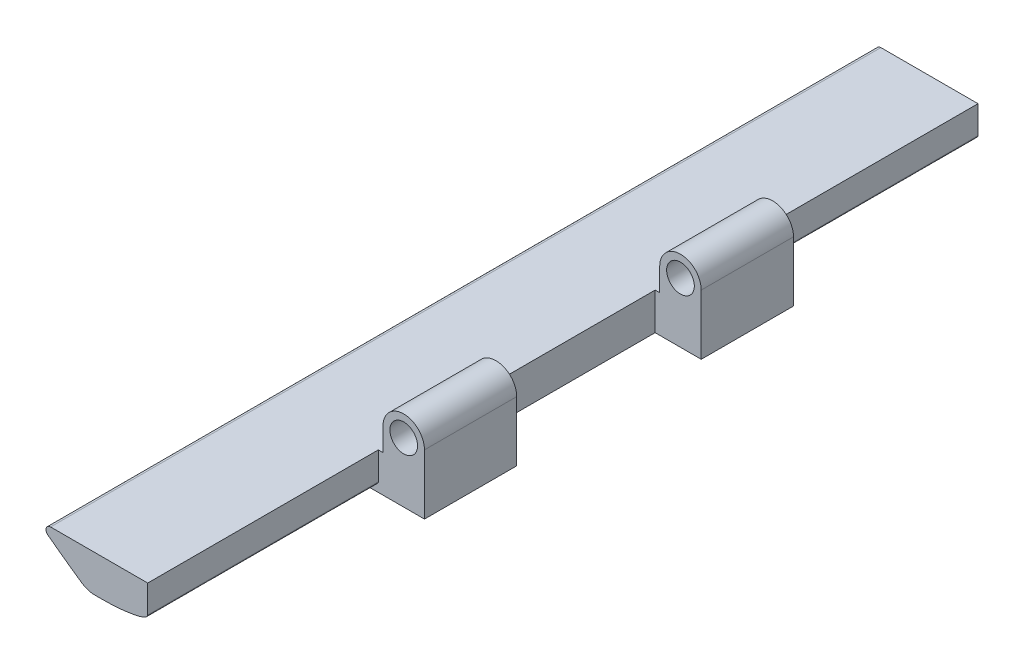
ISO-10303-21;
HEADER;
FILE_DESCRIPTION(('STEP AP214'),'2;1');
FILE_NAME('part.step','',(''),(''),'','','');
FILE_SCHEMA(('AUTOMOTIVE_DESIGN { 1 0 10303 214 1 1 1 1 }'));
ENDSEC;
DATA;
#1=APPLICATION_CONTEXT('core data for automotive mechanical design processes');
#2=APPLICATION_PROTOCOL_DEFINITION('international standard','automotive_design',2000,#1);
#3=PRODUCT_CONTEXT('',#1,'mechanical');
#4=PRODUCT('Part','Part','',(#3));
#5=PRODUCT_RELATED_PRODUCT_CATEGORY('part','',(#4));
#6=PRODUCT_DEFINITION_FORMATION('','',#4);
#7=PRODUCT_DEFINITION_CONTEXT('part definition',#1,'design');
#8=PRODUCT_DEFINITION('design','',#6,#7);
#9=PRODUCT_DEFINITION_SHAPE('','',#8);
#10=(LENGTH_UNIT() NAMED_UNIT(*) SI_UNIT(.MILLI.,.METRE.));
#11=(NAMED_UNIT(*) PLANE_ANGLE_UNIT() SI_UNIT($,.RADIAN.));
#12=(NAMED_UNIT(*) SI_UNIT($,.STERADIAN.) SOLID_ANGLE_UNIT());
#13=UNCERTAINTY_MEASURE_WITH_UNIT(LENGTH_MEASURE(1.E-05),#10,'distance_accuracy_value','');
#14=(GEOMETRIC_REPRESENTATION_CONTEXT(3) GLOBAL_UNCERTAINTY_ASSIGNED_CONTEXT((#13)) GLOBAL_UNIT_ASSIGNED_CONTEXT((#10,
#11,#12)) REPRESENTATION_CONTEXT('',''));
#15=CARTESIAN_POINT('',(0.,0.,0.));
#16=DIRECTION('',(0.,0.,1.));
#17=DIRECTION('',(1.,0.,0.));
#18=AXIS2_PLACEMENT_3D('',#15,#16,#17);
#19=CARTESIAN_POINT('',(75.1966347527541,0.,180.));
#20=DIRECTION('',(-1.,0.,0.));
#21=DIRECTION('',(0.,0.,1.));
#22=AXIS2_PLACEMENT_3D('',#19,#20,#21);
#23=PLANE('',#22);
#24=DIRECTION('',(0.,0.,-1.));
#25=VECTOR('',#24,1.);
#26=CARTESIAN_POINT('',(75.1966347527541,0.936560708709067,180.));
#27=LINE('',#26,#25);
#28=CARTESIAN_POINT('',(75.1966347527541,0.936560708709067,70.));
#29=VERTEX_POINT('',#28);
#30=CARTESIAN_POINT('',(75.1966347527541,0.936560708709067,50.));
#31=VERTEX_POINT('',#30);
#32=EDGE_CURVE('E345',#29,#31,#27,.T.);
#33=ORIENTED_EDGE('',*,*,#32,.F.);
#34=DIRECTION('',(0.,-1.,0.));
#35=VECTOR('',#34,1.);
#36=CARTESIAN_POINT('',(75.1966347527541,19.9365607087089,70.));
#37=LINE('',#36,#35);
#38=CARTESIAN_POINT('',(75.1966347527541,-12.0634392912909,70.));
#39=VERTEX_POINT('',#38);
#40=EDGE_CURVE('E226',#29,#39,#37,.T.);
#41=ORIENTED_EDGE('',*,*,#40,.T.);
#42=DIRECTION('',(0.,0.,-1.));
#43=VECTOR('',#42,1.);
#44=CARTESIAN_POINT('',(75.1966347527541,-12.0634392912909,180.));
#45=LINE('',#44,#43);
#46=CARTESIAN_POINT('',(75.1966347527541,-12.0634392912909,50.));
#47=VERTEX_POINT('',#46);
#48=EDGE_CURVE('E335',#39,#47,#45,.T.);
#49=ORIENTED_EDGE('',*,*,#48,.T.);
#50=DIRECTION('',(0.,-1.,0.));
#51=VECTOR('',#50,1.);
#52=CARTESIAN_POINT('',(75.1966347527541,19.9365607087089,50.));
#53=LINE('',#52,#51);
#54=EDGE_CURVE('E361',#31,#47,#53,.T.);
#55=ORIENTED_EDGE('',*,*,#54,.F.);
#56=EDGE_LOOP('',(#33,#41,#49,#55));
#57=FACE_BOUND('',#56,.T.);
#58=ADVANCED_FACE('F46',(#57),#23,.F.);
#59=CARTESIAN_POINT('',(70.6966347527542,0.936560708709067,180.));
#60=DIRECTION('',(0.,0.,-1.));
#61=DIRECTION('',(-1.,0.,0.));
#62=AXIS2_PLACEMENT_3D('',#59,#60,#61);
#63=CYLINDRICAL_SURFACE('',#62,4.5);
#64=DIRECTION('',(0.,0.,-1.));
#65=VECTOR('',#64,1.);
#66=CARTESIAN_POINT('',(66.1966347527541,0.936560708709067,180.));
#67=LINE('',#66,#65);
#68=CARTESIAN_POINT('',(66.1966347527541,0.936560708709067,70.));
#69=VERTEX_POINT('',#68);
#70=CARTESIAN_POINT('',(66.1966347527541,0.936560708709067,50.));
#71=VERTEX_POINT('',#70);
#72=EDGE_CURVE('E340',#69,#71,#67,.T.);
#73=ORIENTED_EDGE('',*,*,#72,.F.);
#74=CARTESIAN_POINT('',(70.6966347527542,0.936560708709067,70.));
#75=DIRECTION('',(0.,0.,-1.));
#76=DIRECTION('',(-1.,0.,0.));
#77=AXIS2_PLACEMENT_3D('',#74,#75,#76);
#78=CIRCLE('',#77,4.5);
#79=EDGE_CURVE('E252',#69,#29,#78,.T.);
#80=ORIENTED_EDGE('',*,*,#79,.T.);
#81=ORIENTED_EDGE('',*,*,#32,.T.);
#82=CARTESIAN_POINT('',(70.6966347527542,0.936560708709067,50.));
#83=DIRECTION('',(0.,0.,1.));
#84=DIRECTION('',(1.,0.,0.));
#85=AXIS2_PLACEMENT_3D('',#82,#83,#84);
#86=CIRCLE('',#85,4.5);
#87=EDGE_CURVE('E407',#31,#71,#86,.T.);
#88=ORIENTED_EDGE('',*,*,#87,.T.);
#89=EDGE_LOOP('',(#73,#80,#81,#88));
#90=FACE_BOUND('',#89,.T.);
#91=ADVANCED_FACE('F484',(#90),#63,.T.);
#92=CARTESIAN_POINT('',(66.1966347527541,0.,180.));
#93=DIRECTION('',(-1.,0.,0.));
#94=DIRECTION('',(0.,0.,1.));
#95=AXIS2_PLACEMENT_3D('',#92,#93,#94);
#96=PLANE('',#95);
#97=DIRECTION('',(0.,-1.,0.));
#98=VECTOR('',#97,1.);
#99=CARTESIAN_POINT('',(66.1966347527541,0.,70.));
#100=LINE('',#99,#98);
#101=CARTESIAN_POINT('',(66.1966347527541,-4.06343929129093,70.));
#102=VERTEX_POINT('',#101);
#103=EDGE_CURVE('E249',#69,#102,#100,.T.);
#104=ORIENTED_EDGE('',*,*,#103,.F.);
#105=ORIENTED_EDGE('',*,*,#72,.T.);
#106=DIRECTION('',(0.,1.,0.));
#107=VECTOR('',#106,1.);
#108=CARTESIAN_POINT('',(66.1966347527541,0.,50.));
#109=LINE('',#108,#107);
#110=CARTESIAN_POINT('',(66.1966347527541,-4.06343929129093,50.));
#111=VERTEX_POINT('',#110);
#112=EDGE_CURVE('E414',#111,#71,#109,.T.);
#113=ORIENTED_EDGE('',*,*,#112,.F.);
#114=DIRECTION('',(0.,0.,-1.));
#115=VECTOR('',#114,1.);
#116=CARTESIAN_POINT('',(66.1966347527541,-4.06343929129093,180.));
#117=LINE('',#116,#115);
#118=EDGE_CURVE('E334',#102,#111,#117,.T.);
#119=ORIENTED_EDGE('',*,*,#118,.F.);
#120=EDGE_LOOP('',(#104,#105,#113,#119));
#121=FACE_BOUND('',#120,.T.);
#122=ADVANCED_FACE('F479',(#121),#96,.T.);
#123=CARTESIAN_POINT('',(70.6966347527542,0.936560708709067,180.));
#124=DIRECTION('',(0.,0.,-1.));
#125=DIRECTION('',(-1.,0.,0.));
#126=AXIS2_PLACEMENT_3D('',#123,#124,#125);
#127=CYLINDRICAL_SURFACE('',#126,3.00000000000001);
#128=CARTESIAN_POINT('',(70.6966347527542,0.936560708709067,70.));
#129=DIRECTION('',(0.,0.,-1.));
#130=DIRECTION('',(-1.,0.,0.));
#131=AXIS2_PLACEMENT_3D('',#128,#129,#130);
#132=CIRCLE('',#131,3.00000000000001);
#133=CARTESIAN_POINT('',(67.6966347527541,0.936560708709067,70.));
#134=VERTEX_POINT('',#133);
#135=EDGE_CURVE('E245',#134,#134,#132,.T.);
#136=CARTESIAN_POINT('',(70.6966347527542,0.936560708709067,50.));
#137=DIRECTION('',(0.,0.,1.));
#138=DIRECTION('',(1.,0.,0.));
#139=AXIS2_PLACEMENT_3D('',#136,#137,#138);
#140=CIRCLE('',#139,3.00000000000001);
#141=CARTESIAN_POINT('',(67.6966347527541,0.936560708709067,50.));
#142=VERTEX_POINT('',#141);
#143=EDGE_CURVE('E594',#142,#142,#140,.T.);
#144=CARTESIAN_POINT('',(67.6966347527541,0.936560708709067,70.));
#145=CARTESIAN_POINT('',(67.6966347527541,0.936560708709067,69.7916666666667));
#146=CARTESIAN_POINT('',(67.6966347527541,0.936560708709067,69.5833333333334));
#147=CARTESIAN_POINT('',(67.6966347527541,0.936560708709067,69.1666666666667));
#148=CARTESIAN_POINT('',(67.6966347527541,0.936560708709067,68.9583333333334));
#149=CARTESIAN_POINT('',(67.6966347527541,0.936560708709067,68.5416666666667));
#150=CARTESIAN_POINT('',(67.6966347527541,0.936560708709067,68.3333333333334));
#151=CARTESIAN_POINT('',(67.6966347527541,0.936560708709067,67.9166666666667));
#152=CARTESIAN_POINT('',(67.6966347527541,0.936560708709067,67.7083333333334));
#153=CARTESIAN_POINT('',(67.6966347527541,0.936560708709067,67.2916666666667));
#154=CARTESIAN_POINT('',(67.6966347527541,0.936560708709067,67.0833333333333));
#155=CARTESIAN_POINT('',(67.6966347527541,0.936560708709067,66.6666666666667));
#156=CARTESIAN_POINT('',(67.6966347527541,0.936560708709067,66.4583333333333));
#157=CARTESIAN_POINT('',(67.6966347527541,0.936560708709067,66.0416666666667));
#158=CARTESIAN_POINT('',(67.6966347527541,0.936560708709067,65.8333333333333));
#159=CARTESIAN_POINT('',(67.6966347527541,0.936560708709067,65.4166666666667));
#160=CARTESIAN_POINT('',(67.6966347527541,0.936560708709067,65.2083333333333));
#161=CARTESIAN_POINT('',(67.6966347527541,0.936560708709067,64.7916666666667));
#162=CARTESIAN_POINT('',(67.6966347527541,0.936560708709067,64.5833333333333));
#163=CARTESIAN_POINT('',(67.6966347527541,0.936560708709067,64.1666666666667));
#164=CARTESIAN_POINT('',(67.6966347527541,0.936560708709067,63.9583333333333));
#165=CARTESIAN_POINT('',(67.6966347527541,0.936560708709067,63.5416666666667));
#166=CARTESIAN_POINT('',(67.6966347527541,0.936560708709067,63.3333333333333));
#167=CARTESIAN_POINT('',(67.6966347527541,0.936560708709067,62.9166666666667));
#168=CARTESIAN_POINT('',(67.6966347527541,0.936560708709067,62.7083333333333));
#169=CARTESIAN_POINT('',(67.6966347527541,0.936560708709067,62.2916666666667));
#170=CARTESIAN_POINT('',(67.6966347527541,0.936560708709067,62.0833333333333));
#171=CARTESIAN_POINT('',(67.6966347527541,0.936560708709067,61.6666666666667));
#172=CARTESIAN_POINT('',(67.6966347527541,0.936560708709067,61.4583333333333));
#173=CARTESIAN_POINT('',(67.6966347527541,0.936560708709067,61.0416666666667));
#174=CARTESIAN_POINT('',(67.6966347527541,0.936560708709067,60.8333333333333));
#175=CARTESIAN_POINT('',(67.6966347527541,0.936560708709067,60.4166666666667));
#176=CARTESIAN_POINT('',(67.6966347527541,0.936560708709067,60.2083333333333));
#177=CARTESIAN_POINT('',(67.6966347527541,0.936560708709067,59.7916666666667));
#178=CARTESIAN_POINT('',(67.6966347527541,0.936560708709067,59.5833333333333));
#179=CARTESIAN_POINT('',(67.6966347527541,0.936560708709067,59.1666666666667));
#180=CARTESIAN_POINT('',(67.6966347527541,0.936560708709067,58.9583333333333));
#181=CARTESIAN_POINT('',(67.6966347527541,0.936560708709067,58.5416666666667));
#182=CARTESIAN_POINT('',(67.6966347527541,0.936560708709067,58.3333333333333));
#183=CARTESIAN_POINT('',(67.6966347527541,0.936560708709067,57.9166666666667));
#184=CARTESIAN_POINT('',(67.6966347527541,0.936560708709067,57.7083333333333));
#185=CARTESIAN_POINT('',(67.6966347527541,0.936560708709067,57.2916666666666));
#186=CARTESIAN_POINT('',(67.6966347527541,0.936560708709067,57.0833333333333));
#187=CARTESIAN_POINT('',(67.6966347527541,0.936560708709067,56.6666666666666));
#188=CARTESIAN_POINT('',(67.6966347527541,0.936560708709067,56.4583333333333));
#189=CARTESIAN_POINT('',(67.6966347527541,0.936560708709067,56.0416666666666));
#190=CARTESIAN_POINT('',(67.6966347527541,0.936560708709067,55.8333333333333));
#191=CARTESIAN_POINT('',(67.6966347527541,0.936560708709067,55.4166666666666));
#192=CARTESIAN_POINT('',(67.6966347527541,0.936560708709067,55.2083333333333));
#193=CARTESIAN_POINT('',(67.6966347527541,0.936560708709067,54.7916666666666));
#194=CARTESIAN_POINT('',(67.6966347527541,0.936560708709067,54.5833333333333));
#195=CARTESIAN_POINT('',(67.6966347527541,0.936560708709067,54.1666666666666));
#196=CARTESIAN_POINT('',(67.6966347527541,0.936560708709067,53.9583333333333));
#197=CARTESIAN_POINT('',(67.6966347527541,0.936560708709067,53.5416666666666));
#198=CARTESIAN_POINT('',(67.6966347527541,0.936560708709067,53.3333333333333));
#199=CARTESIAN_POINT('',(67.6966347527541,0.936560708709067,52.9166666666666));
#200=CARTESIAN_POINT('',(67.6966347527541,0.936560708709067,52.7083333333333));
#201=CARTESIAN_POINT('',(67.6966347527541,0.936560708709067,52.2916666666666));
#202=CARTESIAN_POINT('',(67.6966347527541,0.936560708709067,52.0833333333333));
#203=CARTESIAN_POINT('',(67.6966347527541,0.936560708709067,51.6666666666666));
#204=CARTESIAN_POINT('',(67.6966347527541,0.936560708709067,51.4583333333333));
#205=CARTESIAN_POINT('',(67.6966347527541,0.936560708709067,51.0416666666666));
#206=CARTESIAN_POINT('',(67.6966347527541,0.936560708709067,50.8333333333333));
#207=CARTESIAN_POINT('',(67.6966347527541,0.936560708709067,50.4166666666666));
#208=CARTESIAN_POINT('',(67.6966347527541,0.936560708709067,50.2083333333333));
#209=CARTESIAN_POINT('',(67.6966347527541,0.936560708709067,50.));
#210=B_SPLINE_CURVE_WITH_KNOTS('',3,(#144,#145,#146,#147,#148,#149,#150,#151,#152,#153,#154,
#155,#156,#157,#158,#159,#160,#161,#162,#163,#164,#165,#166,#167,#168,#169,#170,#171,#172,#173,
#174,#175,#176,#177,#178,#179,#180,#181,#182,#183,#184,#185,#186,#187,#188,#189,#190,#191,#192,
#193,#194,#195,#196,#197,#198,#199,#200,#201,#202,#203,#204,#205,#206,#207,#208,#209),
.UNSPECIFIED.,.F.,.F.,(4,2,2,2,2,2,2,2,2,2,2,2,2,2,2,2,2,2,2,2,2,2,2,2,2,2,2,2,2,2,2,2,4),(0.,
0.625000000000001,1.25,1.875,2.5,3.12500000000002,3.75000000000002,4.37500000000002,
5.00000000000002,5.62500000000002,6.25000000000002,6.87500000000002,7.50000000000003,
8.12500000000004,8.75000000000004,9.37500000000004,10.,10.625,11.25,11.875,12.5,
13.1250000000001,13.7500000000001,14.3750000000001,15.0000000000001,15.625,16.2500000000001,
16.875,17.5000000000001,18.125,18.7500000000001,19.3750000000001,20.0000000000001),.UNSPECIFIED.);
#211=EDGE_CURVE('BSEAM400',#134,#142,#210,.T.);
#212=ORIENTED_EDGE('',*,*,#135,.F.);
#213=ORIENTED_EDGE('',*,*,#143,.F.);
#214=ORIENTED_EDGE('',*,*,#211,.T.);
#215=ORIENTED_EDGE('',*,*,#211,.F.);
#216=EDGE_LOOP('',(#212,#214,#213,#215));
#217=FACE_BOUND('',#216,.T.);
#218=ADVANCED_FACE('F400',(#217),#127,.F.);
#219=CARTESIAN_POINT('',(75.1966347527541,-12.0634392912909,130.));
#220=VERTEX_POINT('',#219);
#221=CARTESIAN_POINT('',(75.1966347527541,-12.0634392912909,110.));
#222=VERTEX_POINT('',#221);
#223=EDGE_CURVE('E331',#220,#222,#45,.T.);
#224=ORIENTED_EDGE('',*,*,#223,.T.);
#225=DIRECTION('',(0.,-1.,0.));
#226=VECTOR('',#225,1.);
#227=CARTESIAN_POINT('',(75.1966347527541,19.9365607087089,110.));
#228=LINE('',#227,#226);
#229=CARTESIAN_POINT('',(75.1966347527541,0.936560708709067,110.));
#230=VERTEX_POINT('',#229);
#231=EDGE_CURVE('E206',#230,#222,#228,.T.);
#232=ORIENTED_EDGE('',*,*,#231,.F.);
#233=CARTESIAN_POINT('',(75.1966347527541,0.936560708709067,130.));
#234=VERTEX_POINT('',#233);
#235=EDGE_CURVE('E346',#234,#230,#27,.T.);
#236=ORIENTED_EDGE('',*,*,#235,.F.);
#237=DIRECTION('',(0.,-1.,0.));
#238=VECTOR('',#237,1.);
#239=CARTESIAN_POINT('',(75.1966347527541,19.9365607087089,130.));
#240=LINE('',#239,#238);
#241=EDGE_CURVE('E259',#234,#220,#240,.T.);
#242=ORIENTED_EDGE('',*,*,#241,.T.);
#243=EDGE_LOOP('',(#224,#232,#236,#242));
#244=FACE_BOUND('',#243,.T.);
#245=ADVANCED_FACE('F482',(#244),#23,.F.);
#246=ORIENTED_EDGE('',*,*,#235,.T.);
#247=CARTESIAN_POINT('',(70.6966347527542,0.936560708709067,110.));
#248=DIRECTION('',(0.,0.,1.));
#249=DIRECTION('',(1.,0.,0.));
#250=AXIS2_PLACEMENT_3D('',#247,#248,#249);
#251=CIRCLE('',#250,4.5);
#252=CARTESIAN_POINT('',(66.1966347527541,0.936560708709067,110.));
#253=VERTEX_POINT('',#252);
#254=EDGE_CURVE('E241',#230,#253,#251,.T.);
#255=ORIENTED_EDGE('',*,*,#254,.T.);
#256=CARTESIAN_POINT('',(66.1966347527541,0.936560708709067,130.));
#257=VERTEX_POINT('',#256);
#258=EDGE_CURVE('E341',#257,#253,#67,.T.);
#259=ORIENTED_EDGE('',*,*,#258,.F.);
#260=CARTESIAN_POINT('',(70.6966347527542,0.936560708709067,130.));
#261=DIRECTION('',(0.,0.,-1.));
#262=DIRECTION('',(-1.,0.,0.));
#263=AXIS2_PLACEMENT_3D('',#260,#261,#262);
#264=CIRCLE('',#263,4.5);
#265=EDGE_CURVE('E420',#257,#234,#264,.T.);
#266=ORIENTED_EDGE('',*,*,#265,.T.);
#267=EDGE_LOOP('',(#246,#255,#259,#266));
#268=FACE_BOUND('',#267,.T.);
#269=ADVANCED_FACE('F477',(#268),#63,.T.);
#270=DIRECTION('',(0.,1.,0.));
#271=VECTOR('',#270,1.);
#272=CARTESIAN_POINT('',(66.1966347527541,0.,110.));
#273=LINE('',#272,#271);
#274=CARTESIAN_POINT('',(66.1966347527541,-4.06343929129093,110.));
#275=VERTEX_POINT('',#274);
#276=EDGE_CURVE('E238',#275,#253,#273,.T.);
#277=ORIENTED_EDGE('',*,*,#276,.F.);
#278=CARTESIAN_POINT('',(66.1966347527541,-4.06343929129093,130.));
#279=VERTEX_POINT('',#278);
#280=EDGE_CURVE('E336',#279,#275,#117,.T.);
#281=ORIENTED_EDGE('',*,*,#280,.F.);
#282=DIRECTION('',(0.,-1.,0.));
#283=VECTOR('',#282,1.);
#284=CARTESIAN_POINT('',(66.1966347527541,0.,130.));
#285=LINE('',#284,#283);
#286=EDGE_CURVE('E411',#257,#279,#285,.T.);
#287=ORIENTED_EDGE('',*,*,#286,.F.);
#288=ORIENTED_EDGE('',*,*,#258,.T.);
#289=EDGE_LOOP('',(#277,#281,#287,#288));
#290=FACE_BOUND('',#289,.T.);
#291=ADVANCED_FACE('F473',(#290),#96,.T.);
#292=CARTESIAN_POINT('',(0.,-4.06343929129093,180.));
#293=DIRECTION('',(0.,1.,0.));
#294=DIRECTION('',(0.,0.,1.));
#295=AXIS2_PLACEMENT_3D('',#292,#293,#294);
#296=PLANE('',#295);
#297=DIRECTION('',(1.,0.,0.));
#298=VECTOR('',#297,1.);
#299=CARTESIAN_POINT('',(0.,-4.06343929129093,0.));
#300=LINE('',#299,#298);
#301=CARTESIAN_POINT('',(44.1453638656436,-4.06343929129093,0.));
#302=VERTEX_POINT('',#301);
#303=CARTESIAN_POINT('',(65.1966347527541,-4.06343929129093,0.));
#304=VERTEX_POINT('',#303);
#305=EDGE_CURVE('E424',#302,#304,#300,.T.);
#306=ORIENTED_EDGE('',*,*,#305,.F.);
#307=DIRECTION('',(0.,0.,1.));
#308=VECTOR('',#307,1.);
#309=CARTESIAN_POINT('',(44.1453638656436,-4.06343929129093,180.));
#310=LINE('',#309,#308);
#311=CARTESIAN_POINT('',(44.1453638656436,-4.06343929129093,180.));
#312=VERTEX_POINT('',#311);
#313=EDGE_CURVE('E379',#302,#312,#310,.T.);
#314=ORIENTED_EDGE('',*,*,#313,.T.);
#315=DIRECTION('',(1.,0.,0.));
#316=VECTOR('',#315,1.);
#317=CARTESIAN_POINT('',(0.,-4.06343929129093,180.));
#318=LINE('',#317,#316);
#319=CARTESIAN_POINT('',(65.1966347527541,-4.06343929129093,180.));
#320=VERTEX_POINT('',#319);
#321=EDGE_CURVE('E324',#312,#320,#318,.T.);
#322=ORIENTED_EDGE('',*,*,#321,.T.);
#323=DIRECTION('',(0.,0.,1.));
#324=VECTOR('',#323,1.);
#325=CARTESIAN_POINT('',(65.1966347527541,-4.06343929129093,180.));
#326=LINE('',#325,#324);
#327=CARTESIAN_POINT('',(65.1966347527541,-4.06343929129093,130.));
#328=VERTEX_POINT('',#327);
#329=EDGE_CURVE('E592',#328,#320,#326,.T.);
#330=ORIENTED_EDGE('',*,*,#329,.F.);
#331=DIRECTION('',(-1.,0.,0.));
#332=VECTOR('',#331,1.);
#333=CARTESIAN_POINT('',(0.,-4.06343929129093,130.));
#334=LINE('',#333,#332);
#335=EDGE_CURVE('E406',#279,#328,#334,.T.);
#336=ORIENTED_EDGE('',*,*,#335,.F.);
#337=ORIENTED_EDGE('',*,*,#280,.T.);
#338=DIRECTION('',(1.,0.,0.));
#339=VECTOR('',#338,1.);
#340=CARTESIAN_POINT('',(0.,-4.06343929129093,110.));
#341=LINE('',#340,#339);
#342=CARTESIAN_POINT('',(65.1966347527541,-4.06343929129093,110.));
#343=VERTEX_POINT('',#342);
#344=EDGE_CURVE('E235',#343,#275,#341,.T.);
#345=ORIENTED_EDGE('',*,*,#344,.F.);
#346=DIRECTION('',(0.,0.,1.));
#347=VECTOR('',#346,1.);
#348=CARTESIAN_POINT('',(65.1966347527541,-4.06343929129093,180.));
#349=LINE('',#348,#347);
#350=CARTESIAN_POINT('',(65.1966347527541,-4.06343929129093,70.));
#351=VERTEX_POINT('',#350);
#352=EDGE_CURVE('E201',#351,#343,#349,.T.);
#353=ORIENTED_EDGE('',*,*,#352,.F.);
#354=DIRECTION('',(-1.,0.,0.));
#355=VECTOR('',#354,1.);
#356=CARTESIAN_POINT('',(0.,-4.06343929129093,70.));
#357=LINE('',#356,#355);
#358=EDGE_CURVE('E246',#102,#351,#357,.T.);
#359=ORIENTED_EDGE('',*,*,#358,.F.);
#360=ORIENTED_EDGE('',*,*,#118,.T.);
#361=DIRECTION('',(1.,0.,0.));
#362=VECTOR('',#361,1.);
#363=CARTESIAN_POINT('',(0.,-4.06343929129093,50.));
#364=LINE('',#363,#362);
#365=CARTESIAN_POINT('',(65.1966347527541,-4.06343929129093,50.));
#366=VERTEX_POINT('',#365);
#367=EDGE_CURVE('E615',#366,#111,#364,.T.);
#368=ORIENTED_EDGE('',*,*,#367,.F.);
#369=DIRECTION('',(0.,0.,1.));
#370=VECTOR('',#369,1.);
#371=CARTESIAN_POINT('',(65.1966347527541,-4.06343929129093,180.));
#372=LINE('',#371,#370);
#373=EDGE_CURVE('E263',#304,#366,#372,.T.);
#374=ORIENTED_EDGE('',*,*,#373,.F.);
#375=EDGE_LOOP('',(#306,#314,#322,#330,#336,#337,#345,#353,#359,#360,#368,#374));
#376=FACE_BOUND('',#375,.T.);
#377=ADVANCED_FACE('F469',(#376),#296,.T.);
#378=CARTESIAN_POINT('',(171.337403754055,163.317618085498,180.));
#379=DIRECTION('',(0.,0.,-1.));
#380=DIRECTION('',(-1.,0.,0.));
#381=AXIS2_PLACEMENT_3D('',#378,#379,#380);
#382=CYLINDRICAL_SURFACE('',#381,212.02131526057);
#383=CARTESIAN_POINT('',(171.337403754055,163.317618085498,0.));
#384=DIRECTION('',(0.,0.,1.));
#385=DIRECTION('',(1.,0.,0.));
#386=AXIS2_PLACEMENT_3D('',#383,#384,#385);
#387=CIRCLE('',#386,212.02131526057);
#388=CARTESIAN_POINT('',(43.5426188788096,-5.86137317379407,0.));
#389=VERTEX_POINT('',#388);
#390=CARTESIAN_POINT('',(50.9042567935745,-11.178500031832,0.));
#391=VERTEX_POINT('',#390);
#392=EDGE_CURVE('E325',#389,#391,#387,.T.);
#393=ORIENTED_EDGE('',*,*,#392,.T.);
#394=DIRECTION('',(0.,0.,-1.));
#395=VECTOR('',#394,1.);
#396=CARTESIAN_POINT('',(50.9042567935745,-11.178500031832,180.));
#397=LINE('',#396,#395);
#398=CARTESIAN_POINT('',(50.9042567935745,-11.178500031832,180.));
#399=VERTEX_POINT('',#398);
#400=EDGE_CURVE('E366',#391,#399,#397,.F.);
#401=ORIENTED_EDGE('',*,*,#400,.T.);
#402=CARTESIAN_POINT('',(171.337403754055,163.317618085498,180.));
#403=DIRECTION('',(0.,0.,1.));
#404=DIRECTION('',(1.,0.,0.));
#405=AXIS2_PLACEMENT_3D('',#402,#403,#404);
#406=CIRCLE('',#405,212.02131526057);
#407=CARTESIAN_POINT('',(43.5426188788096,-5.86137317379407,180.));
#408=VERTEX_POINT('',#407);
#409=EDGE_CURVE('E427',#408,#399,#406,.T.);
#410=ORIENTED_EDGE('',*,*,#409,.F.);
#411=DIRECTION('',(0.,0.,-1.));
#412=VECTOR('',#411,1.);
#413=CARTESIAN_POINT('',(43.5426188788096,-5.86137317379407,180.));
#414=LINE('',#413,#412);
#415=EDGE_CURVE('E385',#408,#389,#414,.T.);
#416=ORIENTED_EDGE('',*,*,#415,.T.);
#417=EDGE_LOOP('',(#393,#401,#410,#416));
#418=FACE_BOUND('',#417,.T.);
#419=ADVANCED_FACE('F456',(#418),#382,.T.);
#420=CARTESIAN_POINT('',(0.,-12.0634392912909,180.));
#421=DIRECTION('',(0.,1.,0.));
#422=DIRECTION('',(0.,0.,1.));
#423=AXIS2_PLACEMENT_3D('',#420,#421,#422);
#424=PLANE('',#423);
#425=DIRECTION('',(1.,0.,0.));
#426=VECTOR('',#425,1.);
#427=CARTESIAN_POINT('',(0.,-12.0634392912909,0.));
#428=LINE('',#427,#426);
#429=CARTESIAN_POINT('',(53.7443756470132,-12.0634392912909,0.));
#430=VERTEX_POINT('',#429);
#431=CARTESIAN_POINT('',(55.1966347527541,-12.0634392912909,0.));
#432=VERTEX_POINT('',#431);
#433=EDGE_CURVE('E315',#430,#432,#428,.T.);
#434=ORIENTED_EDGE('',*,*,#433,.T.);
#435=CARTESIAN_POINT('',(55.1966347527541,-12.0634392912909,52.5));
#436=CARTESIAN_POINT('',(55.1966347527541,-12.0634392912909,34.1666666666667));
#437=CARTESIAN_POINT('',(55.1966347527541,-12.0634392912909,15.8333333333333));
#438=CARTESIAN_POINT('',(55.1966347527541,-12.0634392912909,-2.49999999999999));
#439=(BOUNDED_CURVE() B_SPLINE_CURVE(3,(#435,#436,#437,#438),.UNSPECIFIED.,.F.,
.F.) B_SPLINE_CURVE_WITH_KNOTS((4,4),(-0.0525,0.0025),
.UNSPECIFIED.) CURVE() GEOMETRIC_REPRESENTATION_ITEM() RATIONAL_B_SPLINE_CURVE((1.,1.,1.,1.)) REPRESENTATION_ITEM(''));
#440=CARTESIAN_POINT('',(55.1966347527541,-12.0634392912909,50.));
#441=VERTEX_POINT('',#440);
#442=EDGE_CURVE('E533',#432,#441,#439,.F.);
#443=ORIENTED_EDGE('',*,*,#442,.T.);
#444=DIRECTION('',(-1.,0.,0.));
#445=VECTOR('',#444,1.);
#446=CARTESIAN_POINT('',(75.1966347527541,-12.0634392912909,50.));
#447=LINE('',#446,#445);
#448=EDGE_CURVE('E258',#47,#441,#447,.T.);
#449=ORIENTED_EDGE('',*,*,#448,.F.);
#450=ORIENTED_EDGE('',*,*,#48,.F.);
#451=DIRECTION('',(1.,0.,0.));
#452=VECTOR('',#451,1.);
#453=CARTESIAN_POINT('',(75.1966347527541,-12.0634392912909,70.));
#454=LINE('',#453,#452);
#455=CARTESIAN_POINT('',(65.1966347527541,-12.0634392912909,70.));
#456=VERTEX_POINT('',#455);
#457=EDGE_CURVE('E220',#456,#39,#454,.T.);
#458=ORIENTED_EDGE('',*,*,#457,.F.);
#459=DIRECTION('',(0.,0.,-1.));
#460=VECTOR('',#459,1.);
#461=CARTESIAN_POINT('',(65.1966347527541,-12.0634392912909,110.));
#462=LINE('',#461,#460);
#463=CARTESIAN_POINT('',(65.1966347527541,-12.0634392912909,110.));
#464=VERTEX_POINT('',#463);
#465=EDGE_CURVE('E198',#464,#456,#462,.T.);
#466=ORIENTED_EDGE('',*,*,#465,.F.);
#467=DIRECTION('',(-1.,0.,0.));
#468=VECTOR('',#467,1.);
#469=CARTESIAN_POINT('',(75.1966347527541,-12.0634392912909,110.));
#470=LINE('',#469,#468);
#471=EDGE_CURVE('E209',#222,#464,#470,.T.);
#472=ORIENTED_EDGE('',*,*,#471,.F.);
#473=ORIENTED_EDGE('',*,*,#223,.F.);
#474=DIRECTION('',(1.,0.,0.));
#475=VECTOR('',#474,1.);
#476=CARTESIAN_POINT('',(75.1966347527541,-12.0634392912909,130.));
#477=LINE('',#476,#475);
#478=CARTESIAN_POINT('',(55.1966347527541,-12.0634392912909,130.));
#479=VERTEX_POINT('',#478);
#480=EDGE_CURVE('E274',#479,#220,#477,.T.);
#481=ORIENTED_EDGE('',*,*,#480,.F.);
#482=CARTESIAN_POINT('',(55.1966347527541,-12.0634392912909,182.5));
#483=CARTESIAN_POINT('',(55.1966347527541,-12.0634392912909,164.166666666667));
#484=CARTESIAN_POINT('',(55.1966347527541,-12.0634392912909,145.833333333333));
#485=CARTESIAN_POINT('',(55.1966347527541,-12.0634392912909,127.5));
#486=(BOUNDED_CURVE() B_SPLINE_CURVE(3,(#482,#483,#484,#485),.UNSPECIFIED.,.F.,
.F.) B_SPLINE_CURVE_WITH_KNOTS((4,4),(-0.0025,0.0525),
.UNSPECIFIED.) CURVE() GEOMETRIC_REPRESENTATION_ITEM() RATIONAL_B_SPLINE_CURVE((1.,1.,1.,1.)) REPRESENTATION_ITEM(''));
#487=CARTESIAN_POINT('',(55.1966347527541,-12.0634392912909,180.));
#488=VERTEX_POINT('',#487);
#489=EDGE_CURVE('E441',#479,#488,#486,.F.);
#490=ORIENTED_EDGE('',*,*,#489,.T.);
#491=DIRECTION('',(1.,0.,0.));
#492=VECTOR('',#491,1.);
#493=CARTESIAN_POINT('',(0.,-12.0634392912909,180.));
#494=LINE('',#493,#492);
#495=CARTESIAN_POINT('',(53.7443756470132,-12.0634392912909,180.));
#496=VERTEX_POINT('',#495);
#497=EDGE_CURVE('E431',#496,#488,#494,.T.);
#498=ORIENTED_EDGE('',*,*,#497,.F.);
#499=DIRECTION('',(0.,0.,-1.));
#500=VECTOR('',#499,1.);
#501=CARTESIAN_POINT('',(53.7443756470132,-12.0634392912909,180.));
#502=LINE('',#501,#500);
#503=EDGE_CURVE('E372',#496,#430,#502,.T.);
#504=ORIENTED_EDGE('',*,*,#503,.T.);
#505=EDGE_LOOP('',(#434,#443,#449,#450,#458,#466,#472,#473,#481,#490,#498,#504));
#506=FACE_BOUND('',#505,.T.);
#507=ADVANCED_FACE('F218',(#506),#424,.F.);
#508=CARTESIAN_POINT('',(0.,0.,180.));
#509=DIRECTION('',(0.,0.,1.));
#510=DIRECTION('',(1.,0.,0.));
#511=AXIS2_PLACEMENT_3D('',#508,#509,#510);
#512=PLANE('',#511);
#513=ORIENTED_EDGE('',*,*,#497,.T.);
#514=CARTESIAN_POINT('',(65.1966347527541,-10.0634392912909,180.));
#515=CARTESIAN_POINT('',(65.1966347527541,-12.0634392912909,180.));
#516=CARTESIAN_POINT('',(55.1966347527541,-12.0634392912909,180.));
#517=(BOUNDED_CURVE() B_SPLINE_CURVE(2,(#514,#515,#516),.UNSPECIFIED.,.F.,
.F.) B_SPLINE_CURVE_WITH_KNOTS((3,3),(0.,1.),
.UNSPECIFIED.) CURVE() GEOMETRIC_REPRESENTATION_ITEM() RATIONAL_B_SPLINE_CURVE((1.,
0.707106781186548,1.)) REPRESENTATION_ITEM(''));
#518=CARTESIAN_POINT('',(65.1966347527541,-10.0634392912909,180.));
#519=VERTEX_POINT('',#518);
#520=EDGE_CURVE('E74',#488,#519,#517,.F.);
#521=ORIENTED_EDGE('',*,*,#520,.T.);
#522=DIRECTION('',(0.,-1.,0.));
#523=VECTOR('',#522,1.);
#524=CARTESIAN_POINT('',(65.1966347527541,0.,180.));
#525=LINE('',#524,#523);
#526=EDGE_CURVE('E275',#320,#519,#525,.T.);
#527=ORIENTED_EDGE('',*,*,#526,.F.);
#528=ORIENTED_EDGE('',*,*,#321,.F.);
#529=CARTESIAN_POINT('',(44.1453638656436,-5.06343929129088,180.));
#530=DIRECTION('',(0.,0.,1.));
#531=DIRECTION('',(1.,0.,0.));
#532=AXIS2_PLACEMENT_3D('',#529,#530,#531);
#533=CIRCLE('',#532,1.);
#534=EDGE_CURVE('E376',#312,#408,#533,.T.);
#535=ORIENTED_EDGE('',*,*,#534,.T.);
#536=ORIENTED_EDGE('',*,*,#409,.T.);
#537=CARTESIAN_POINT('',(53.7443756470132,-7.06343929129089,180.));
#538=DIRECTION('',(0.,0.,1.));
#539=DIRECTION('',(1.,0.,0.));
#540=AXIS2_PLACEMENT_3D('',#537,#538,#539);
#541=CIRCLE('',#540,5.);
#542=EDGE_CURVE('E362',#399,#496,#541,.T.);
#543=ORIENTED_EDGE('',*,*,#542,.T.);
#544=EDGE_LOOP('',(#513,#521,#527,#528,#535,#536,#543));
#545=FACE_BOUND('',#544,.T.);
#546=ADVANCED_FACE('F455',(#545),#512,.T.);
#547=CARTESIAN_POINT('',(0.,0.,0.));
#548=DIRECTION('',(0.,0.,1.));
#549=DIRECTION('',(1.,0.,0.));
#550=AXIS2_PLACEMENT_3D('',#547,#548,#549);
#551=PLANE('',#550);
#552=DIRECTION('',(0.,-1.,0.));
#553=VECTOR('',#552,1.);
#554=CARTESIAN_POINT('',(65.1966347527541,0.,0.));
#555=LINE('',#554,#553);
#556=CARTESIAN_POINT('',(65.1966347527541,-10.0634392912909,0.));
#557=VERTEX_POINT('',#556);
#558=EDGE_CURVE('E350',#304,#557,#555,.T.);
#559=ORIENTED_EDGE('',*,*,#558,.T.);
#560=CARTESIAN_POINT('',(55.1966347527541,-12.0634392912909,0.));
#561=CARTESIAN_POINT('',(65.1966347527541,-12.0634392912909,0.));
#562=CARTESIAN_POINT('',(65.1966347527541,-10.0634392912909,0.));
#563=(BOUNDED_CURVE() B_SPLINE_CURVE(2,(#560,#561,#562),.UNSPECIFIED.,.F.,
.F.) B_SPLINE_CURVE_WITH_KNOTS((3,3),(0.,1.),
.UNSPECIFIED.) CURVE() GEOMETRIC_REPRESENTATION_ITEM() RATIONAL_B_SPLINE_CURVE((1.,
0.707106781186548,1.)) REPRESENTATION_ITEM(''));
#564=EDGE_CURVE('E646',#557,#432,#563,.F.);
#565=ORIENTED_EDGE('',*,*,#564,.T.);
#566=ORIENTED_EDGE('',*,*,#433,.F.);
#567=CARTESIAN_POINT('',(53.7443756470132,-7.06343929129089,0.));
#568=DIRECTION('',(0.,0.,1.));
#569=DIRECTION('',(1.,0.,0.));
#570=AXIS2_PLACEMENT_3D('',#567,#568,#569);
#571=CIRCLE('',#570,5.);
#572=EDGE_CURVE('E369',#430,#391,#571,.F.);
#573=ORIENTED_EDGE('',*,*,#572,.T.);
#574=ORIENTED_EDGE('',*,*,#392,.F.);
#575=CARTESIAN_POINT('',(44.1453638656436,-5.06343929129088,0.));
#576=DIRECTION('',(0.,0.,1.));
#577=DIRECTION('',(1.,0.,0.));
#578=AXIS2_PLACEMENT_3D('',#575,#576,#577);
#579=CIRCLE('',#578,1.);
#580=EDGE_CURVE('E382',#389,#302,#579,.F.);
#581=ORIENTED_EDGE('',*,*,#580,.T.);
#582=ORIENTED_EDGE('',*,*,#305,.T.);
#583=EDGE_LOOP('',(#559,#565,#566,#573,#574,#581,#582));
#584=FACE_BOUND('',#583,.T.);
#585=ADVANCED_FACE('F457',(#584),#551,.F.);
#586=CARTESIAN_POINT('',(75.1966347527541,19.9365607087089,50.));
#587=DIRECTION('',(0.,0.,1.));
#588=DIRECTION('',(1.,0.,0.));
#589=AXIS2_PLACEMENT_3D('',#586,#587,#588);
#590=PLANE('',#589);
#591=ORIENTED_EDGE('',*,*,#143,.T.);
#592=EDGE_LOOP('',(#591));
#593=FACE_BOUND('',#592,.T.);
#594=ORIENTED_EDGE('',*,*,#54,.T.);
#595=ORIENTED_EDGE('',*,*,#448,.T.);
#596=CARTESIAN_POINT('',(65.1966347527541,-10.0634392912909,50.));
#597=CARTESIAN_POINT('',(65.1966347527541,-12.0634392912909,50.));
#598=CARTESIAN_POINT('',(55.1966347527541,-12.0634392912909,50.));
#599=(BOUNDED_CURVE() B_SPLINE_CURVE(2,(#596,#597,#598),.UNSPECIFIED.,.F.,
.F.) B_SPLINE_CURVE_WITH_KNOTS((3,3),(0.,1.),
.UNSPECIFIED.) CURVE() GEOMETRIC_REPRESENTATION_ITEM() RATIONAL_B_SPLINE_CURVE((1.,
0.707106781186548,1.)) REPRESENTATION_ITEM(''));
#600=CARTESIAN_POINT('',(65.1966347527541,-10.0634392912909,50.));
#601=VERTEX_POINT('',#600);
#602=EDGE_CURVE('E60',#441,#601,#599,.F.);
#603=ORIENTED_EDGE('',*,*,#602,.T.);
#604=DIRECTION('',(0.,-1.,0.));
#605=VECTOR('',#604,1.);
#606=CARTESIAN_POINT('',(65.1966347527541,19.9365607087089,50.));
#607=LINE('',#606,#605);
#608=EDGE_CURVE('E357',#366,#601,#607,.T.);
#609=ORIENTED_EDGE('',*,*,#608,.F.);
#610=ORIENTED_EDGE('',*,*,#367,.T.);
#611=ORIENTED_EDGE('',*,*,#112,.T.);
#612=ORIENTED_EDGE('',*,*,#87,.F.);
#613=EDGE_LOOP('',(#594,#595,#603,#609,#610,#611,#612));
#614=FACE_BOUND('',#613,.T.);
#615=ADVANCED_FACE('F304',(#593,#614),#590,.F.);
#616=CARTESIAN_POINT('',(65.1966347527541,19.9365607087089,0.));
#617=DIRECTION('',(-1.,0.,0.));
#618=DIRECTION('',(0.,0.,1.));
#619=AXIS2_PLACEMENT_3D('',#616,#617,#618);
#620=PLANE('',#619);
#621=ORIENTED_EDGE('',*,*,#608,.T.);
#622=CARTESIAN_POINT('',(65.1966347527541,-10.0634392912909,-2.49999999999999));
#623=CARTESIAN_POINT('',(65.1966347527541,-10.0634392912909,15.8333333333333));
#624=CARTESIAN_POINT('',(65.1966347527541,-10.0634392912909,34.1666666666667));
#625=CARTESIAN_POINT('',(65.1966347527541,-10.0634392912909,52.5));
#626=(BOUNDED_CURVE() B_SPLINE_CURVE(3,(#622,#623,#624,#625),.UNSPECIFIED.,.F.,
.F.) B_SPLINE_CURVE_WITH_KNOTS((4,4),(-0.0525,0.0025),
.UNSPECIFIED.) CURVE() GEOMETRIC_REPRESENTATION_ITEM() RATIONAL_B_SPLINE_CURVE((1.,1.,1.,1.)) REPRESENTATION_ITEM(''));
#627=EDGE_CURVE('E365',#601,#557,#626,.F.);
#628=ORIENTED_EDGE('',*,*,#627,.T.);
#629=ORIENTED_EDGE('',*,*,#558,.F.);
#630=ORIENTED_EDGE('',*,*,#373,.T.);
#631=EDGE_LOOP('',(#621,#628,#629,#630));
#632=FACE_BOUND('',#631,.T.);
#633=ADVANCED_FACE('F300',(#632),#620,.F.);
#634=CARTESIAN_POINT('',(75.1966347527541,19.9365607087089,130.));
#635=DIRECTION('',(0.,0.,-1.));
#636=DIRECTION('',(-1.,0.,0.));
#637=AXIS2_PLACEMENT_3D('',#634,#635,#636);
#638=PLANE('',#637);
#639=CARTESIAN_POINT('',(70.6966347527542,0.936560708709067,130.));
#640=DIRECTION('',(0.,0.,-1.));
#641=DIRECTION('',(-1.,0.,0.));
#642=AXIS2_PLACEMENT_3D('',#639,#640,#641);
#643=CIRCLE('',#642,3.00000000000001);
#644=CARTESIAN_POINT('',(67.6966347527541,0.936560708709067,130.));
#645=VERTEX_POINT('',#644);
#646=EDGE_CURVE('E403',#645,#645,#643,.T.);
#647=ORIENTED_EDGE('',*,*,#646,.T.);
#648=EDGE_LOOP('',(#647));
#649=FACE_BOUND('',#648,.T.);
#650=ORIENTED_EDGE('',*,*,#286,.T.);
#651=ORIENTED_EDGE('',*,*,#335,.T.);
#652=DIRECTION('',(0.,-1.,0.));
#653=VECTOR('',#652,1.);
#654=CARTESIAN_POINT('',(65.1966347527541,19.9365607087089,130.));
#655=LINE('',#654,#653);
#656=CARTESIAN_POINT('',(65.1966347527541,-10.0634392912909,130.));
#657=VERTEX_POINT('',#656);
#658=EDGE_CURVE('E264',#328,#657,#655,.T.);
#659=ORIENTED_EDGE('',*,*,#658,.T.);
#660=CARTESIAN_POINT('',(55.1966347527541,-12.0634392912909,130.));
#661=CARTESIAN_POINT('',(65.1966347527541,-12.0634392912909,130.));
#662=CARTESIAN_POINT('',(65.1966347527541,-10.0634392912909,130.));
#663=(BOUNDED_CURVE() B_SPLINE_CURVE(2,(#660,#661,#662),.UNSPECIFIED.,.F.,
.F.) B_SPLINE_CURVE_WITH_KNOTS((3,3),(0.,1.),
.UNSPECIFIED.) CURVE() GEOMETRIC_REPRESENTATION_ITEM() RATIONAL_B_SPLINE_CURVE((1.,
0.707106781186548,1.)) REPRESENTATION_ITEM(''));
#664=EDGE_CURVE('E12',#657,#479,#663,.F.);
#665=ORIENTED_EDGE('',*,*,#664,.T.);
#666=ORIENTED_EDGE('',*,*,#480,.T.);
#667=ORIENTED_EDGE('',*,*,#241,.F.);
#668=ORIENTED_EDGE('',*,*,#265,.F.);
#669=EDGE_LOOP('',(#650,#651,#659,#665,#666,#667,#668));
#670=FACE_BOUND('',#669,.T.);
#671=ADVANCED_FACE('F297',(#649,#670),#638,.F.);
#672=CARTESIAN_POINT('',(65.1966347527541,19.9365607087089,180.));
#673=DIRECTION('',(-1.,0.,0.));
#674=DIRECTION('',(0.,0.,1.));
#675=AXIS2_PLACEMENT_3D('',#672,#673,#674);
#676=PLANE('',#675);
#677=ORIENTED_EDGE('',*,*,#526,.T.);
#678=CARTESIAN_POINT('',(65.1966347527541,-10.0634392912909,127.5));
#679=CARTESIAN_POINT('',(65.1966347527541,-10.0634392912909,145.833333333333));
#680=CARTESIAN_POINT('',(65.1966347527541,-10.0634392912909,164.166666666667));
#681=CARTESIAN_POINT('',(65.1966347527541,-10.0634392912909,182.5));
#682=(BOUNDED_CURVE() B_SPLINE_CURVE(3,(#678,#679,#680,#681),.UNSPECIFIED.,.F.,
.F.) B_SPLINE_CURVE_WITH_KNOTS((4,4),(-0.0025,0.0525),
.UNSPECIFIED.) CURVE() GEOMETRIC_REPRESENTATION_ITEM() RATIONAL_B_SPLINE_CURVE((1.,1.,1.,1.)) REPRESENTATION_ITEM(''));
#683=EDGE_CURVE('E281',#519,#657,#682,.F.);
#684=ORIENTED_EDGE('',*,*,#683,.T.);
#685=ORIENTED_EDGE('',*,*,#658,.F.);
#686=ORIENTED_EDGE('',*,*,#329,.T.);
#687=EDGE_LOOP('',(#677,#684,#685,#686));
#688=FACE_BOUND('',#687,.T.);
#689=ADVANCED_FACE('F286',(#688),#676,.F.);
#690=CARTESIAN_POINT('',(70.6966347527542,0.936560708709067,110.));
#691=DIRECTION('',(0.,0.,1.));
#692=DIRECTION('',(1.,0.,0.));
#693=AXIS2_PLACEMENT_3D('',#690,#691,#692);
#694=CIRCLE('',#693,3.00000000000001);
#695=CARTESIAN_POINT('',(67.6966347527541,0.936560708709067,110.));
#696=VERTEX_POINT('',#695);
#697=EDGE_CURVE('E230',#696,#696,#694,.T.);
#698=CARTESIAN_POINT('',(67.6966347527541,0.936560708709067,110.));
#699=CARTESIAN_POINT('',(67.6966347527541,0.936560708709067,110.208333333333));
#700=CARTESIAN_POINT('',(67.6966347527541,0.936560708709067,110.416666666667));
#701=CARTESIAN_POINT('',(67.6966347527541,0.936560708709067,110.833333333333));
#702=CARTESIAN_POINT('',(67.6966347527541,0.936560708709067,111.041666666667));
#703=CARTESIAN_POINT('',(67.6966347527541,0.936560708709067,111.458333333333));
#704=CARTESIAN_POINT('',(67.6966347527541,0.936560708709067,111.666666666667));
#705=CARTESIAN_POINT('',(67.6966347527541,0.936560708709067,112.083333333333));
#706=CARTESIAN_POINT('',(67.6966347527541,0.936560708709067,112.291666666667));
#707=CARTESIAN_POINT('',(67.6966347527541,0.936560708709067,112.708333333333));
#708=CARTESIAN_POINT('',(67.6966347527541,0.936560708709067,112.916666666667));
#709=CARTESIAN_POINT('',(67.6966347527541,0.936560708709067,113.333333333333));
#710=CARTESIAN_POINT('',(67.6966347527541,0.936560708709067,113.541666666667));
#711=CARTESIAN_POINT('',(67.6966347527541,0.936560708709067,113.958333333333));
#712=CARTESIAN_POINT('',(67.6966347527541,0.936560708709067,114.166666666667));
#713=CARTESIAN_POINT('',(67.6966347527541,0.936560708709067,114.583333333333));
#714=CARTESIAN_POINT('',(67.6966347527541,0.936560708709067,114.791666666667));
#715=CARTESIAN_POINT('',(67.6966347527541,0.936560708709067,115.208333333333));
#716=CARTESIAN_POINT('',(67.6966347527541,0.936560708709067,115.416666666667));
#717=CARTESIAN_POINT('',(67.6966347527541,0.936560708709067,115.833333333333));
#718=CARTESIAN_POINT('',(67.6966347527541,0.936560708709067,116.041666666667));
#719=CARTESIAN_POINT('',(67.6966347527541,0.936560708709067,116.458333333333));
#720=CARTESIAN_POINT('',(67.6966347527541,0.936560708709067,116.666666666667));
#721=CARTESIAN_POINT('',(67.6966347527541,0.936560708709067,117.083333333333));
#722=CARTESIAN_POINT('',(67.6966347527541,0.936560708709067,117.291666666667));
#723=CARTESIAN_POINT('',(67.6966347527541,0.936560708709067,117.708333333333));
#724=CARTESIAN_POINT('',(67.6966347527541,0.936560708709067,117.916666666667));
#725=CARTESIAN_POINT('',(67.6966347527541,0.936560708709067,118.333333333333));
#726=CARTESIAN_POINT('',(67.6966347527541,0.936560708709067,118.541666666667));
#727=CARTESIAN_POINT('',(67.6966347527541,0.936560708709067,118.958333333333));
#728=CARTESIAN_POINT('',(67.6966347527541,0.936560708709067,119.166666666667));
#729=CARTESIAN_POINT('',(67.6966347527541,0.936560708709067,119.583333333333));
#730=CARTESIAN_POINT('',(67.6966347527541,0.936560708709067,119.791666666667));
#731=CARTESIAN_POINT('',(67.6966347527541,0.936560708709067,120.208333333333));
#732=CARTESIAN_POINT('',(67.6966347527541,0.936560708709067,120.416666666667));
#733=CARTESIAN_POINT('',(67.6966347527541,0.936560708709067,120.833333333333));
#734=CARTESIAN_POINT('',(67.6966347527541,0.936560708709067,121.041666666667));
#735=CARTESIAN_POINT('',(67.6966347527541,0.936560708709067,121.458333333333));
#736=CARTESIAN_POINT('',(67.6966347527541,0.936560708709067,121.666666666667));
#737=CARTESIAN_POINT('',(67.6966347527541,0.936560708709067,122.083333333333));
#738=CARTESIAN_POINT('',(67.6966347527541,0.936560708709067,122.291666666667));
#739=CARTESIAN_POINT('',(67.6966347527541,0.936560708709067,122.708333333333));
#740=CARTESIAN_POINT('',(67.6966347527541,0.936560708709067,122.916666666667));
#741=CARTESIAN_POINT('',(67.6966347527541,0.936560708709067,123.333333333333));
#742=CARTESIAN_POINT('',(67.6966347527541,0.936560708709067,123.541666666667));
#743=CARTESIAN_POINT('',(67.6966347527541,0.936560708709067,123.958333333333));
#744=CARTESIAN_POINT('',(67.6966347527541,0.936560708709067,124.166666666667));
#745=CARTESIAN_POINT('',(67.6966347527541,0.936560708709067,124.583333333333));
#746=CARTESIAN_POINT('',(67.6966347527541,0.936560708709067,124.791666666667));
#747=CARTESIAN_POINT('',(67.6966347527541,0.936560708709067,125.208333333333));
#748=CARTESIAN_POINT('',(67.6966347527541,0.936560708709067,125.416666666667));
#749=CARTESIAN_POINT('',(67.6966347527541,0.936560708709067,125.833333333333));
#750=CARTESIAN_POINT('',(67.6966347527541,0.936560708709067,126.041666666667));
#751=CARTESIAN_POINT('',(67.6966347527541,0.936560708709067,126.458333333333));
#752=CARTESIAN_POINT('',(67.6966347527541,0.936560708709067,126.666666666667));
#753=CARTESIAN_POINT('',(67.6966347527541,0.936560708709067,127.083333333333));
#754=CARTESIAN_POINT('',(67.6966347527541,0.936560708709067,127.291666666667));
#755=CARTESIAN_POINT('',(67.6966347527541,0.936560708709067,127.708333333333));
#756=CARTESIAN_POINT('',(67.6966347527541,0.936560708709067,127.916666666667));
#757=CARTESIAN_POINT('',(67.6966347527541,0.936560708709067,128.333333333333));
#758=CARTESIAN_POINT('',(67.6966347527541,0.936560708709067,128.541666666667));
#759=CARTESIAN_POINT('',(67.6966347527541,0.936560708709067,128.958333333333));
#760=CARTESIAN_POINT('',(67.6966347527541,0.936560708709067,129.166666666667));
#761=CARTESIAN_POINT('',(67.6966347527541,0.936560708709067,129.583333333333));
#762=CARTESIAN_POINT('',(67.6966347527541,0.936560708709067,129.791666666667));
#763=CARTESIAN_POINT('',(67.6966347527541,0.936560708709067,130.));
#764=B_SPLINE_CURVE_WITH_KNOTS('',3,(#698,#699,#700,#701,#702,#703,#704,#705,#706,#707,#708,
#709,#710,#711,#712,#713,#714,#715,#716,#717,#718,#719,#720,#721,#722,#723,#724,#725,#726,#727,
#728,#729,#730,#731,#732,#733,#734,#735,#736,#737,#738,#739,#740,#741,#742,#743,#744,#745,#746,
#747,#748,#749,#750,#751,#752,#753,#754,#755,#756,#757,#758,#759,#760,#761,#762,#763),
.UNSPECIFIED.,.F.,.F.,(4,2,2,2,2,2,2,2,2,2,2,2,2,2,2,2,2,2,2,2,2,2,2,2,2,2,2,2,2,2,2,2,4),(0.,
0.625000000000001,1.25,1.875,2.5,3.125,3.75,4.375,5.,5.62500000000001,6.25000000000001,
6.87500000000001,7.50000000000001,8.12500000000001,8.75000000000001,9.37500000000001,10.,10.625,
11.25,11.875,12.5,13.125,13.75,14.375,15.,15.625,16.25,16.875,17.5,18.125,18.75,19.375,20.),.UNSPECIFIED.);
#765=EDGE_CURVE('BSEAM296',#696,#645,#764,.T.);
#766=ORIENTED_EDGE('',*,*,#697,.F.);
#767=ORIENTED_EDGE('',*,*,#646,.F.);
#768=ORIENTED_EDGE('',*,*,#765,.T.);
#769=ORIENTED_EDGE('',*,*,#765,.F.);
#770=EDGE_LOOP('',(#766,#768,#767,#769));
#771=FACE_BOUND('',#770,.T.);
#772=ADVANCED_FACE('F296',(#771),#127,.F.);
#773=CARTESIAN_POINT('',(75.1966347527541,19.9365607087089,70.));
#774=DIRECTION('',(0.,0.,-1.));
#775=DIRECTION('',(-1.,0.,0.));
#776=AXIS2_PLACEMENT_3D('',#773,#774,#775);
#777=PLANE('',#776);
#778=ORIENTED_EDGE('',*,*,#135,.T.);
#779=EDGE_LOOP('',(#778));
#780=FACE_BOUND('',#779,.T.);
#781=ORIENTED_EDGE('',*,*,#103,.T.);
#782=ORIENTED_EDGE('',*,*,#358,.T.);
#783=DIRECTION('',(0.,-1.,0.));
#784=VECTOR('',#783,1.);
#785=CARTESIAN_POINT('',(65.1966347527541,19.9365607087089,70.));
#786=LINE('',#785,#784);
#787=EDGE_CURVE('E205',#351,#456,#786,.T.);
#788=ORIENTED_EDGE('',*,*,#787,.T.);
#789=ORIENTED_EDGE('',*,*,#457,.T.);
#790=ORIENTED_EDGE('',*,*,#40,.F.);
#791=ORIENTED_EDGE('',*,*,#79,.F.);
#792=EDGE_LOOP('',(#781,#782,#788,#789,#790,#791));
#793=FACE_BOUND('',#792,.T.);
#794=ADVANCED_FACE('F398',(#780,#793),#777,.F.);
#795=CARTESIAN_POINT('',(75.1966347527541,19.9365607087089,110.));
#796=DIRECTION('',(0.,0.,1.));
#797=DIRECTION('',(1.,0.,0.));
#798=AXIS2_PLACEMENT_3D('',#795,#796,#797);
#799=PLANE('',#798);
#800=ORIENTED_EDGE('',*,*,#697,.T.);
#801=EDGE_LOOP('',(#800));
#802=FACE_BOUND('',#801,.T.);
#803=ORIENTED_EDGE('',*,*,#231,.T.);
#804=ORIENTED_EDGE('',*,*,#471,.T.);
#805=DIRECTION('',(0.,-1.,0.));
#806=VECTOR('',#805,1.);
#807=CARTESIAN_POINT('',(65.1966347527541,19.9365607087089,110.));
#808=LINE('',#807,#806);
#809=EDGE_CURVE('E193',#343,#464,#808,.T.);
#810=ORIENTED_EDGE('',*,*,#809,.F.);
#811=ORIENTED_EDGE('',*,*,#344,.T.);
#812=ORIENTED_EDGE('',*,*,#276,.T.);
#813=ORIENTED_EDGE('',*,*,#254,.F.);
#814=EDGE_LOOP('',(#803,#804,#810,#811,#812,#813));
#815=FACE_BOUND('',#814,.T.);
#816=ADVANCED_FACE('F210',(#802,#815),#799,.F.);
#817=CARTESIAN_POINT('',(65.1966347527541,19.9365607087089,110.));
#818=DIRECTION('',(-1.,0.,0.));
#819=DIRECTION('',(0.,0.,1.));
#820=AXIS2_PLACEMENT_3D('',#817,#818,#819);
#821=PLANE('',#820);
#822=ORIENTED_EDGE('',*,*,#352,.T.);
#823=ORIENTED_EDGE('',*,*,#809,.T.);
#824=ORIENTED_EDGE('',*,*,#465,.T.);
#825=ORIENTED_EDGE('',*,*,#787,.F.);
#826=EDGE_LOOP('',(#822,#823,#824,#825));
#827=FACE_BOUND('',#826,.T.);
#828=ADVANCED_FACE('F195',(#827),#821,.F.);
#829=CARTESIAN_POINT('',(44.1453638656436,-5.06343929129088,180.));
#830=DIRECTION('',(0.,0.,-1.));
#831=DIRECTION('',(-1.,0.,0.));
#832=AXIS2_PLACEMENT_3D('',#829,#830,#831);
#833=CYLINDRICAL_SURFACE('',#832,1.);
#834=ORIENTED_EDGE('',*,*,#534,.F.);
#835=ORIENTED_EDGE('',*,*,#313,.F.);
#836=ORIENTED_EDGE('',*,*,#580,.F.);
#837=ORIENTED_EDGE('',*,*,#415,.F.);
#838=EDGE_LOOP('',(#834,#835,#836,#837));
#839=FACE_BOUND('',#838,.T.);
#840=ADVANCED_FACE('F488',(#839),#833,.T.);
#841=CARTESIAN_POINT('',(53.7443756470132,-7.06343929129089,180.));
#842=DIRECTION('',(0.,0.,-1.));
#843=DIRECTION('',(-1.,0.,0.));
#844=AXIS2_PLACEMENT_3D('',#841,#842,#843);
#845=CYLINDRICAL_SURFACE('',#844,5.);
#846=ORIENTED_EDGE('',*,*,#542,.F.);
#847=ORIENTED_EDGE('',*,*,#400,.F.);
#848=ORIENTED_EDGE('',*,*,#572,.F.);
#849=ORIENTED_EDGE('',*,*,#503,.F.);
#850=EDGE_LOOP('',(#846,#847,#848,#849));
#851=FACE_BOUND('',#850,.T.);
#852=ADVANCED_FACE('F491',(#851),#845,.T.);
#853=CARTESIAN_POINT('',(65.1966347527541,-10.0634392912909,52.5));
#854=CARTESIAN_POINT('',(65.1966347527541,-10.0634392912909,34.1666666666667));
#855=CARTESIAN_POINT('',(65.1966347527541,-10.0634392912909,15.8333333333333));
#856=CARTESIAN_POINT('',(65.1966347527541,-10.0634392912909,-2.49999999999999));
#857=CARTESIAN_POINT('',(65.1966347527541,-12.0634392912909,52.5));
#858=CARTESIAN_POINT('',(65.1966347527541,-12.0634392912909,34.1666666666667));
#859=CARTESIAN_POINT('',(65.1966347527541,-12.0634392912909,15.8333333333333));
#860=CARTESIAN_POINT('',(65.1966347527541,-12.0634392912909,-2.49999999999999));
#861=CARTESIAN_POINT('',(55.1966347527541,-12.0634392912909,52.5));
#862=CARTESIAN_POINT('',(55.1966347527541,-12.0634392912909,34.1666666666667));
#863=CARTESIAN_POINT('',(55.1966347527541,-12.0634392912909,15.8333333333333));
#864=CARTESIAN_POINT('',(55.1966347527541,-12.0634392912909,-2.49999999999999));
#865=(BOUNDED_SURFACE() B_SPLINE_SURFACE(2,3,((#853,#854,#855,#856),(#857,#858,#859,#860),(#861,
#862,#863,#864)),.UNSPECIFIED.,.F.,.F.,.F.) B_SPLINE_SURFACE_WITH_KNOTS((3,3),(4,4),(0.,1.),
(-0.0525,0.0025),.UNSPECIFIED.) GEOMETRIC_REPRESENTATION_ITEM() RATIONAL_B_SPLINE_SURFACE(((1.,
1.,1.,1.),(0.707106781186548,0.707106781186548,0.707106781186548,0.707106781186548),(1.,1.,1.,1.))) REPRESENTATION_ITEM('') SURFACE());
#866=ORIENTED_EDGE('',*,*,#602,.F.);
#867=ORIENTED_EDGE('',*,*,#442,.F.);
#868=ORIENTED_EDGE('',*,*,#564,.F.);
#869=ORIENTED_EDGE('',*,*,#627,.F.);
#870=EDGE_LOOP('',(#866,#867,#868,#869));
#871=FACE_BOUND('',#870,.T.);
#872=ADVANCED_FACE('F494',(#871),#865,.T.);
#873=CARTESIAN_POINT('',(65.1966347527541,-10.0634392912909,182.5));
#874=CARTESIAN_POINT('',(65.1966347527541,-10.0634392912909,164.166666666667));
#875=CARTESIAN_POINT('',(65.1966347527541,-10.0634392912909,145.833333333333));
#876=CARTESIAN_POINT('',(65.1966347527541,-10.0634392912909,127.5));
#877=CARTESIAN_POINT('',(65.1966347527541,-12.0634392912909,182.5));
#878=CARTESIAN_POINT('',(65.1966347527541,-12.0634392912909,164.166666666667));
#879=CARTESIAN_POINT('',(65.1966347527541,-12.0634392912909,145.833333333333));
#880=CARTESIAN_POINT('',(65.1966347527541,-12.0634392912909,127.5));
#881=CARTESIAN_POINT('',(55.1966347527541,-12.0634392912909,182.5));
#882=CARTESIAN_POINT('',(55.1966347527541,-12.0634392912909,164.166666666667));
#883=CARTESIAN_POINT('',(55.1966347527541,-12.0634392912909,145.833333333333));
#884=CARTESIAN_POINT('',(55.1966347527541,-12.0634392912909,127.5));
#885=(BOUNDED_SURFACE() B_SPLINE_SURFACE(2,3,((#873,#874,#875,#876),(#877,#878,#879,#880),(#881,
#882,#883,#884)),.UNSPECIFIED.,.F.,.F.,.F.) B_SPLINE_SURFACE_WITH_KNOTS((3,3),(4,4),(0.,1.),
(-0.0025,0.0525),.UNSPECIFIED.) GEOMETRIC_REPRESENTATION_ITEM() RATIONAL_B_SPLINE_SURFACE(((1.,
1.,1.,1.),(0.707106781186548,0.707106781186548,0.707106781186548,0.707106781186548),(1.,1.,1.,1.))) REPRESENTATION_ITEM('') SURFACE());
#886=ORIENTED_EDGE('',*,*,#520,.F.);
#887=ORIENTED_EDGE('',*,*,#489,.F.);
#888=ORIENTED_EDGE('',*,*,#664,.F.);
#889=ORIENTED_EDGE('',*,*,#683,.F.);
#890=EDGE_LOOP('',(#886,#887,#888,#889));
#891=FACE_BOUND('',#890,.T.);
#892=ADVANCED_FACE('F49',(#891),#885,.T.);
#893=CLOSED_SHELL('',(#58,#91,#122,#218,#245,#269,#291,#377,#419,#507,#546,#585,#615,#633,#671,
#689,#772,#794,#816,#828,#840,#852,#872,#892));
#894=MANIFOLD_SOLID_BREP('B2',#893);
#895=ADVANCED_BREP_SHAPE_REPRESENTATION('',(#18,#894),#14);
#896=SHAPE_DEFINITION_REPRESENTATION(#9,#895);
ENDSEC;
END-ISO-10303-21;
